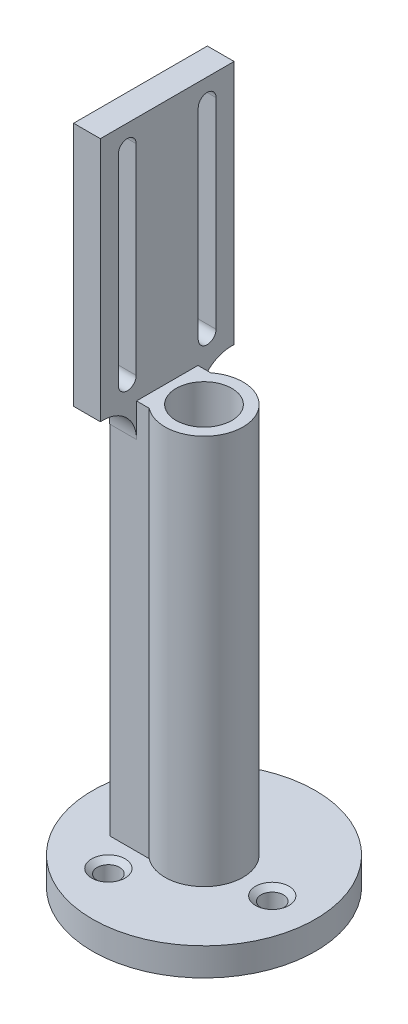
ISO-10303-21;
HEADER;
FILE_DESCRIPTION(('STEP AP214'),'2;1');
FILE_NAME('part.step','',(''),(''),'','','');
FILE_SCHEMA(('AUTOMOTIVE_DESIGN { 1 0 10303 214 1 1 1 1 }'));
ENDSEC;
DATA;
#1=APPLICATION_CONTEXT('core data for automotive mechanical design processes');
#2=APPLICATION_PROTOCOL_DEFINITION('international standard','automotive_design',2000,#1);
#3=PRODUCT_CONTEXT('',#1,'mechanical');
#4=PRODUCT('Part','Part','',(#3));
#5=PRODUCT_RELATED_PRODUCT_CATEGORY('part','',(#4));
#6=PRODUCT_DEFINITION_FORMATION('','',#4);
#7=PRODUCT_DEFINITION_CONTEXT('part definition',#1,'design');
#8=PRODUCT_DEFINITION('design','',#6,#7);
#9=PRODUCT_DEFINITION_SHAPE('','',#8);
#10=(LENGTH_UNIT() NAMED_UNIT(*) SI_UNIT(.MILLI.,.METRE.));
#11=(NAMED_UNIT(*) PLANE_ANGLE_UNIT() SI_UNIT($,.RADIAN.));
#12=(NAMED_UNIT(*) SI_UNIT($,.STERADIAN.) SOLID_ANGLE_UNIT());
#13=UNCERTAINTY_MEASURE_WITH_UNIT(LENGTH_MEASURE(1.E-05),#10,'distance_accuracy_value','');
#14=(GEOMETRIC_REPRESENTATION_CONTEXT(3) GLOBAL_UNCERTAINTY_ASSIGNED_CONTEXT((#13)) GLOBAL_UNIT_ASSIGNED_CONTEXT((#10,
#11,#12)) REPRESENTATION_CONTEXT('',''));
#15=CARTESIAN_POINT('',(0.,0.,0.));
#16=DIRECTION('',(0.,0.,1.));
#17=DIRECTION('',(1.,0.,0.));
#18=AXIS2_PLACEMENT_3D('',#15,#16,#17);
#19=CARTESIAN_POINT('',(6.35,114.3,0.));
#20=DIRECTION('',(0.,-1.,0.));
#21=DIRECTION('',(0.,0.,-1.));
#22=AXIS2_PLACEMENT_3D('',#19,#20,#21);
#23=PLANE('',#22);
#24=CARTESIAN_POINT('',(0.,114.3,0.));
#25=DIRECTION('',(0.,1.,0.));
#26=DIRECTION('',(0.,0.,1.));
#27=AXIS2_PLACEMENT_3D('',#24,#25,#26);
#28=CIRCLE('',#27,6.35);
#29=CARTESIAN_POINT('',(0.,114.3,6.35));
#30=VERTEX_POINT('',#29);
#31=EDGE_CURVE('E330',#30,#30,#28,.T.);
#32=ORIENTED_EDGE('',*,*,#31,.F.);
#33=EDGE_LOOP('',(#32));
#34=FACE_BOUND('',#33,.T.);
#35=DIRECTION('',(0.,0.,-1.));
#36=VECTOR('',#35,1.);
#37=CARTESIAN_POINT('',(-8.38200000000001,114.3,15.24));
#38=LINE('',#37,#36);
#39=CARTESIAN_POINT('',(-8.38200000000001,114.3,7.));
#40=VERTEX_POINT('',#39);
#41=CARTESIAN_POINT('',(-8.38200000000001,114.3,-6.99999999999998));
#42=VERTEX_POINT('',#41);
#43=EDGE_CURVE('E260',#40,#42,#38,.T.);
#44=ORIENTED_EDGE('',*,*,#43,.F.);
#45=DIRECTION('',(1.,0.,0.));
#46=VECTOR('',#45,1.);
#47=CARTESIAN_POINT('',(-5.48015510729397,114.3,7.));
#48=LINE('',#47,#46);
#49=CARTESIAN_POINT('',(-5.48015510729397,114.3,7.));
#50=VERTEX_POINT('',#49);
#51=EDGE_CURVE('E282',#40,#50,#48,.T.);
#52=ORIENTED_EDGE('',*,*,#51,.T.);
#53=CARTESIAN_POINT('',(0.,114.3,0.));
#54=DIRECTION('',(0.,1.,0.));
#55=DIRECTION('',(0.,0.,1.));
#56=AXIS2_PLACEMENT_3D('',#53,#54,#55);
#57=CIRCLE('',#56,8.89000000000001);
#58=CARTESIAN_POINT('',(-5.48015510729397,114.3,-7.));
#59=VERTEX_POINT('',#58);
#60=EDGE_CURVE('E327',#50,#59,#57,.T.);
#61=ORIENTED_EDGE('',*,*,#60,.T.);
#62=DIRECTION('',(-1.,0.,0.));
#63=VECTOR('',#62,1.);
#64=CARTESIAN_POINT('',(-14.478,114.3,-7.));
#65=LINE('',#64,#63);
#66=EDGE_CURVE('E279',#59,#42,#65,.T.);
#67=ORIENTED_EDGE('',*,*,#66,.T.);
#68=EDGE_LOOP('',(#44,#52,#61,#67));
#69=FACE_BOUND('',#68,.T.);
#70=ADVANCED_FACE('F37',(#34,#69),#23,.F.);
#71=CARTESIAN_POINT('',(0.,131.176985840386,0.));
#72=DIRECTION('',(0.,1.,0.));
#73=DIRECTION('',(0.,0.,1.));
#74=AXIS2_PLACEMENT_3D('',#71,#72,#73);
#75=CYLINDRICAL_SURFACE('',#74,8.89000000000001);
#76=DIRECTION('',(0.,-1.,0.));
#77=VECTOR('',#76,1.);
#78=CARTESIAN_POINT('',(-5.48015510729397,114.3,-7.));
#79=LINE('',#78,#77);
#80=CARTESIAN_POINT('',(-5.48015510729397,25.4,-7.));
#81=VERTEX_POINT('',#80);
#82=EDGE_CURVE('E298',#59,#81,#79,.T.);
#83=ORIENTED_EDGE('',*,*,#82,.F.);
#84=ORIENTED_EDGE('',*,*,#60,.F.);
#85=DIRECTION('',(0.,-1.,0.));
#86=VECTOR('',#85,1.);
#87=CARTESIAN_POINT('',(-5.48015510729397,114.3,7.));
#88=LINE('',#87,#86);
#89=CARTESIAN_POINT('',(-5.48015510729397,25.4,7.));
#90=VERTEX_POINT('',#89);
#91=EDGE_CURVE('E285',#50,#90,#88,.T.);
#92=ORIENTED_EDGE('',*,*,#91,.T.);
#93=CARTESIAN_POINT('',(0.,25.4,0.));
#94=DIRECTION('',(0.,1.,0.));
#95=DIRECTION('',(0.,0.,1.));
#96=AXIS2_PLACEMENT_3D('',#93,#94,#95);
#97=CIRCLE('',#96,8.89000000000001);
#98=EDGE_CURVE('E342',#90,#81,#97,.T.);
#99=ORIENTED_EDGE('',*,*,#98,.T.);
#100=EDGE_LOOP('',(#83,#84,#92,#99));
#101=FACE_BOUND('',#100,.T.);
#102=ADVANCED_FACE('F419',(#101),#75,.T.);
#103=CARTESIAN_POINT('',(25.4,25.4,0.));
#104=DIRECTION('',(0.,-1.,0.));
#105=DIRECTION('',(0.,0.,-1.));
#106=AXIS2_PLACEMENT_3D('',#103,#104,#105);
#107=PLANE('',#106);
#108=CARTESIAN_POINT('',(0.,25.4,0.));
#109=DIRECTION('',(0.,1.,0.));
#110=DIRECTION('',(0.,0.,1.));
#111=AXIS2_PLACEMENT_3D('',#108,#109,#110);
#112=CIRCLE('',#111,25.4);
#113=CARTESIAN_POINT('',(0.,25.4,25.4));
#114=VERTEX_POINT('',#113);
#115=EDGE_CURVE('E339',#114,#114,#112,.T.);
#116=ORIENTED_EDGE('',*,*,#115,.T.);
#117=EDGE_LOOP('',(#116));
#118=FACE_BOUND('',#117,.T.);
#119=CARTESIAN_POINT('',(-8.21231440560172,25.4,13.5857836396545));
#120=DIRECTION('',(0.,1.,0.));
#121=DIRECTION('',(0.,0.,1.));
#122=AXIS2_PLACEMENT_3D('',#119,#120,#121);
#123=CIRCLE('',#122,3.81);
#124=CARTESIAN_POINT('',(-8.21231440560172,25.4,17.3957836396545));
#125=VERTEX_POINT('',#124);
#126=EDGE_CURVE('E318',#125,#125,#123,.T.);
#127=ORIENTED_EDGE('',*,*,#126,.F.);
#128=EDGE_LOOP('',(#127));
#129=FACE_BOUND('',#128,.T.);
#130=CARTESIAN_POINT('',(15.8717909650625,25.4,0.319181079288262));
#131=DIRECTION('',(0.,1.,0.));
#132=DIRECTION('',(0.,0.,1.));
#133=AXIS2_PLACEMENT_3D('',#130,#131,#132);
#134=CIRCLE('',#133,3.81);
#135=CARTESIAN_POINT('',(15.8717909650625,25.4,4.12918107928826));
#136=VERTEX_POINT('',#135);
#137=EDGE_CURVE('E309',#136,#136,#134,.T.);
#138=ORIENTED_EDGE('',*,*,#137,.F.);
#139=EDGE_LOOP('',(#138));
#140=FACE_BOUND('',#139,.T.);
#141=CARTESIAN_POINT('',(-7.65947655945847,25.4,-13.904964718945));
#142=DIRECTION('',(0.,1.,0.));
#143=DIRECTION('',(0.,0.,1.));
#144=AXIS2_PLACEMENT_3D('',#141,#142,#143);
#145=CIRCLE('',#144,3.81);
#146=CARTESIAN_POINT('',(-7.65947655945847,25.4,-10.094964718945));
#147=VERTEX_POINT('',#146);
#148=EDGE_CURVE('E300',#147,#147,#145,.T.);
#149=ORIENTED_EDGE('',*,*,#148,.F.);
#150=EDGE_LOOP('',(#149));
#151=FACE_BOUND('',#150,.T.);
#152=DIRECTION('',(-1.,0.,0.));
#153=VECTOR('',#152,1.);
#154=CARTESIAN_POINT('',(-14.478,25.4,-7.));
#155=LINE('',#154,#153);
#156=CARTESIAN_POINT('',(-14.478,25.4,-7.));
#157=VERTEX_POINT('',#156);
#158=EDGE_CURVE('E278',#81,#157,#155,.T.);
#159=ORIENTED_EDGE('',*,*,#158,.F.);
#160=ORIENTED_EDGE('',*,*,#98,.F.);
#161=DIRECTION('',(1.,0.,0.));
#162=VECTOR('',#161,1.);
#163=CARTESIAN_POINT('',(-5.48015510729397,25.4,7.));
#164=LINE('',#163,#162);
#165=CARTESIAN_POINT('',(-14.478,25.4,7.));
#166=VERTEX_POINT('',#165);
#167=EDGE_CURVE('E283',#166,#90,#164,.T.);
#168=ORIENTED_EDGE('',*,*,#167,.F.);
#169=DIRECTION('',(0.,0.,1.));
#170=VECTOR('',#169,1.);
#171=CARTESIAN_POINT('',(-14.478,25.4,7.));
#172=LINE('',#171,#170);
#173=EDGE_CURVE('E288',#157,#166,#172,.T.);
#174=ORIENTED_EDGE('',*,*,#173,.F.);
#175=EDGE_LOOP('',(#159,#160,#168,#174));
#176=FACE_BOUND('',#175,.T.);
#177=ADVANCED_FACE('F384',(#118,#129,#140,#151,#176),#107,.F.);
#178=CARTESIAN_POINT('',(0.,131.176985840386,0.));
#179=DIRECTION('',(0.,1.,0.));
#180=DIRECTION('',(0.,0.,1.));
#181=AXIS2_PLACEMENT_3D('',#178,#179,#180);
#182=CYLINDRICAL_SURFACE('',#181,25.4);
#183=ORIENTED_EDGE('',*,*,#115,.F.);
#184=EDGE_LOOP('',(#183));
#185=FACE_BOUND('',#184,.T.);
#186=CARTESIAN_POINT('',(0.,19.05,0.));
#187=DIRECTION('',(0.,1.,0.));
#188=DIRECTION('',(0.,0.,1.));
#189=AXIS2_PLACEMENT_3D('',#186,#187,#188);
#190=CIRCLE('',#189,25.4);
#191=CARTESIAN_POINT('',(0.,19.05,25.4));
#192=VERTEX_POINT('',#191);
#193=EDGE_CURVE('E336',#192,#192,#190,.T.);
#194=ORIENTED_EDGE('',*,*,#193,.T.);
#195=EDGE_LOOP('',(#194));
#196=FACE_BOUND('',#195,.T.);
#197=ADVANCED_FACE('F440',(#185,#196),#182,.T.);
#198=CARTESIAN_POINT('',(6.35000000000001,19.05,0.));
#199=DIRECTION('',(0.,1.,0.));
#200=DIRECTION('',(0.,0.,1.));
#201=AXIS2_PLACEMENT_3D('',#198,#199,#200);
#202=PLANE('',#201);
#203=CARTESIAN_POINT('',(-7.65947655945847,19.05,-13.904964718945));
#204=DIRECTION('',(0.,1.,0.));
#205=DIRECTION('',(0.,0.,1.));
#206=AXIS2_PLACEMENT_3D('',#203,#204,#205);
#207=CIRCLE('',#206,2.5527);
#208=CARTESIAN_POINT('',(-7.65947655945847,19.05,-11.352264718945));
#209=VERTEX_POINT('',#208);
#210=EDGE_CURVE('E306',#209,#209,#207,.T.);
#211=ORIENTED_EDGE('',*,*,#210,.T.);
#212=EDGE_LOOP('',(#211));
#213=FACE_BOUND('',#212,.T.);
#214=CARTESIAN_POINT('',(15.8717909650625,19.05,0.319181079288262));
#215=DIRECTION('',(0.,1.,0.));
#216=DIRECTION('',(0.,0.,1.));
#217=AXIS2_PLACEMENT_3D('',#214,#215,#216);
#218=CIRCLE('',#217,2.5527);
#219=CARTESIAN_POINT('',(15.8717909650625,19.05,2.87188107928826));
#220=VERTEX_POINT('',#219);
#221=EDGE_CURVE('E315',#220,#220,#218,.T.);
#222=ORIENTED_EDGE('',*,*,#221,.T.);
#223=EDGE_LOOP('',(#222));
#224=FACE_BOUND('',#223,.T.);
#225=CARTESIAN_POINT('',(-8.21231440560172,19.05,13.5857836396545));
#226=DIRECTION('',(0.,1.,0.));
#227=DIRECTION('',(0.,0.,1.));
#228=AXIS2_PLACEMENT_3D('',#225,#226,#227);
#229=CIRCLE('',#228,2.5527);
#230=CARTESIAN_POINT('',(-8.21231440560172,19.05,16.1384836396545));
#231=VERTEX_POINT('',#230);
#232=EDGE_CURVE('E324',#231,#231,#229,.T.);
#233=ORIENTED_EDGE('',*,*,#232,.T.);
#234=EDGE_LOOP('',(#233));
#235=FACE_BOUND('',#234,.T.);
#236=ORIENTED_EDGE('',*,*,#193,.F.);
#237=EDGE_LOOP('',(#236));
#238=FACE_BOUND('',#237,.T.);
#239=CARTESIAN_POINT('',(0.,19.05,0.));
#240=DIRECTION('',(0.,1.,0.));
#241=DIRECTION('',(0.,0.,1.));
#242=AXIS2_PLACEMENT_3D('',#239,#240,#241);
#243=CIRCLE('',#242,6.35000000000001);
#244=CARTESIAN_POINT('',(0.,19.05,6.35000000000001));
#245=VERTEX_POINT('',#244);
#246=EDGE_CURVE('E333',#245,#245,#243,.T.);
#247=ORIENTED_EDGE('',*,*,#246,.T.);
#248=EDGE_LOOP('',(#247));
#249=FACE_BOUND('',#248,.T.);
#250=ADVANCED_FACE('F436',(#213,#224,#235,#238,#249),#202,.F.);
#251=CARTESIAN_POINT('',(0.,131.176985840386,0.));
#252=DIRECTION('',(0.,1.,0.));
#253=DIRECTION('',(0.,0.,1.));
#254=AXIS2_PLACEMENT_3D('',#251,#252,#253);
#255=CYLINDRICAL_SURFACE('',#254,6.35000000000001);
#256=ORIENTED_EDGE('',*,*,#246,.F.);
#257=EDGE_LOOP('',(#256));
#258=FACE_BOUND('',#257,.T.);
#259=ORIENTED_EDGE('',*,*,#31,.T.);
#260=EDGE_LOOP('',(#259));
#261=FACE_BOUND('',#260,.T.);
#262=ADVANCED_FACE('F433',(#258,#261),#255,.F.);
#263=CARTESIAN_POINT('',(-8.21231440560172,25.4,13.5857836396545));
#264=DIRECTION('',(0.,1.,0.));
#265=DIRECTION('',(0.,0.,1.));
#266=AXIS2_PLACEMENT_3D('',#263,#264,#265);
#267=CYLINDRICAL_SURFACE('',#266,2.5527);
#268=ORIENTED_EDGE('',*,*,#232,.F.);
#269=EDGE_LOOP('',(#268));
#270=FACE_BOUND('',#269,.T.);
#271=CARTESIAN_POINT('',(-8.21231440560172,24.3450000337208,13.5857836396545));
#272=DIRECTION('',(0.,1.,0.));
#273=DIRECTION('',(0.,0.,1.));
#274=AXIS2_PLACEMENT_3D('',#271,#272,#273);
#275=CIRCLE('',#274,2.5527);
#276=CARTESIAN_POINT('',(-8.21231440560172,24.3450000337208,16.1384836396545));
#277=VERTEX_POINT('',#276);
#278=EDGE_CURVE('E321',#277,#277,#275,.T.);
#279=ORIENTED_EDGE('',*,*,#278,.T.);
#280=EDGE_LOOP('',(#279));
#281=FACE_BOUND('',#280,.T.);
#282=ADVANCED_FACE('F431',(#270,#281),#267,.F.);
#283=CARTESIAN_POINT('',(-8.21231440560172,25.4,13.5857836396545));
#284=DIRECTION('',(0.,1.,0.));
#285=DIRECTION('',(0.,0.,1.));
#286=AXIS2_PLACEMENT_3D('',#283,#284,#285);
#287=CONICAL_SURFACE('',#286,3.81,0.872664625997163);
#288=ORIENTED_EDGE('',*,*,#278,.F.);
#289=EDGE_LOOP('',(#288));
#290=FACE_BOUND('',#289,.T.);
#291=ORIENTED_EDGE('',*,*,#126,.T.);
#292=EDGE_LOOP('',(#291));
#293=FACE_BOUND('',#292,.T.);
#294=ADVANCED_FACE('F510',(#290,#293),#287,.F.);
#295=CARTESIAN_POINT('',(15.8717909650625,25.4,0.319181079288262));
#296=DIRECTION('',(0.,1.,0.));
#297=DIRECTION('',(0.,0.,1.));
#298=AXIS2_PLACEMENT_3D('',#295,#296,#297);
#299=CYLINDRICAL_SURFACE('',#298,2.5527);
#300=ORIENTED_EDGE('',*,*,#221,.F.);
#301=EDGE_LOOP('',(#300));
#302=FACE_BOUND('',#301,.T.);
#303=CARTESIAN_POINT('',(15.8717909650625,24.3450000337208,0.319181079288262));
#304=DIRECTION('',(0.,1.,0.));
#305=DIRECTION('',(0.,0.,1.));
#306=AXIS2_PLACEMENT_3D('',#303,#304,#305);
#307=CIRCLE('',#306,2.5527);
#308=CARTESIAN_POINT('',(15.8717909650625,24.3450000337208,2.87188107928826));
#309=VERTEX_POINT('',#308);
#310=EDGE_CURVE('E312',#309,#309,#307,.T.);
#311=ORIENTED_EDGE('',*,*,#310,.T.);
#312=EDGE_LOOP('',(#311));
#313=FACE_BOUND('',#312,.T.);
#314=ADVANCED_FACE('F507',(#302,#313),#299,.F.);
#315=CARTESIAN_POINT('',(15.8717909650625,25.4,0.319181079288262));
#316=DIRECTION('',(0.,1.,0.));
#317=DIRECTION('',(0.,0.,1.));
#318=AXIS2_PLACEMENT_3D('',#315,#316,#317);
#319=CONICAL_SURFACE('',#318,3.81,0.872664625997163);
#320=ORIENTED_EDGE('',*,*,#310,.F.);
#321=EDGE_LOOP('',(#320));
#322=FACE_BOUND('',#321,.T.);
#323=ORIENTED_EDGE('',*,*,#137,.T.);
#324=EDGE_LOOP('',(#323));
#325=FACE_BOUND('',#324,.T.);
#326=ADVANCED_FACE('F503',(#322,#325),#319,.F.);
#327=CARTESIAN_POINT('',(-7.65947655945847,25.4,-13.904964718945));
#328=DIRECTION('',(0.,1.,0.));
#329=DIRECTION('',(0.,0.,1.));
#330=AXIS2_PLACEMENT_3D('',#327,#328,#329);
#331=CYLINDRICAL_SURFACE('',#330,2.5527);
#332=ORIENTED_EDGE('',*,*,#210,.F.);
#333=EDGE_LOOP('',(#332));
#334=FACE_BOUND('',#333,.T.);
#335=CARTESIAN_POINT('',(-7.65947655945847,24.3450000337208,-13.904964718945));
#336=DIRECTION('',(0.,1.,0.));
#337=DIRECTION('',(0.,0.,1.));
#338=AXIS2_PLACEMENT_3D('',#335,#336,#337);
#339=CIRCLE('',#338,2.5527);
#340=CARTESIAN_POINT('',(-7.65947655945847,24.3450000337208,-11.352264718945));
#341=VERTEX_POINT('',#340);
#342=EDGE_CURVE('E303',#341,#341,#339,.T.);
#343=ORIENTED_EDGE('',*,*,#342,.T.);
#344=EDGE_LOOP('',(#343));
#345=FACE_BOUND('',#344,.T.);
#346=ADVANCED_FACE('F499',(#334,#345),#331,.F.);
#347=CARTESIAN_POINT('',(-7.65947655945847,25.4,-13.904964718945));
#348=DIRECTION('',(0.,1.,0.));
#349=DIRECTION('',(0.,0.,1.));
#350=AXIS2_PLACEMENT_3D('',#347,#348,#349);
#351=CONICAL_SURFACE('',#350,3.81,0.872664625997163);
#352=ORIENTED_EDGE('',*,*,#342,.F.);
#353=EDGE_LOOP('',(#352));
#354=FACE_BOUND('',#353,.T.);
#355=ORIENTED_EDGE('',*,*,#148,.T.);
#356=EDGE_LOOP('',(#355));
#357=FACE_BOUND('',#356,.T.);
#358=ADVANCED_FACE('F496',(#354,#357),#351,.F.);
#359=CARTESIAN_POINT('',(-14.478,114.3,-7.));
#360=DIRECTION('',(0.,0.,1.));
#361=DIRECTION('',(1.,0.,0.));
#362=AXIS2_PLACEMENT_3D('',#359,#360,#361);
#363=PLANE('',#362);
#364=DIRECTION('',(0.,-1.,0.));
#365=VECTOR('',#364,1.);
#366=CARTESIAN_POINT('',(-14.478,114.3,-7.));
#367=LINE('',#366,#365);
#368=CARTESIAN_POINT('',(-14.478,106.68,-7.));
#369=VERTEX_POINT('',#368);
#370=EDGE_CURVE('E296',#369,#157,#367,.T.);
#371=ORIENTED_EDGE('',*,*,#370,.F.);
#372=DIRECTION('',(-1.,0.,0.));
#373=VECTOR('',#372,1.);
#374=CARTESIAN_POINT('',(-8.38200000000001,106.68,-7.));
#375=LINE('',#374,#373);
#376=CARTESIAN_POINT('',(-8.38200000000001,106.68,-7.));
#377=VERTEX_POINT('',#376);
#378=EDGE_CURVE('E350',#369,#377,#375,.F.);
#379=ORIENTED_EDGE('',*,*,#378,.T.);
#380=DIRECTION('',(0.,1.,0.));
#381=VECTOR('',#380,1.);
#382=CARTESIAN_POINT('',(-8.38200000000001,170.18,-7.));
#383=LINE('',#382,#381);
#384=EDGE_CURVE('E348',#377,#42,#383,.T.);
#385=ORIENTED_EDGE('',*,*,#384,.T.);
#386=ORIENTED_EDGE('',*,*,#66,.F.);
#387=ORIENTED_EDGE('',*,*,#82,.T.);
#388=ORIENTED_EDGE('',*,*,#158,.T.);
#389=EDGE_LOOP('',(#371,#379,#385,#386,#387,#388));
#390=FACE_BOUND('',#389,.T.);
#391=ADVANCED_FACE('F377',(#390),#363,.F.);
#392=CARTESIAN_POINT('',(-14.478,114.3,7.));
#393=DIRECTION('',(1.,0.,0.));
#394=DIRECTION('',(0.,0.,-1.));
#395=AXIS2_PLACEMENT_3D('',#392,#393,#394);
#396=PLANE('',#395);
#397=DIRECTION('',(0.,1.,0.));
#398=VECTOR('',#397,1.);
#399=CARTESIAN_POINT('',(-14.478,119.38,11.132));
#400=LINE('',#399,#398);
#401=CARTESIAN_POINT('',(-14.478,119.38,11.132));
#402=VERTEX_POINT('',#401);
#403=CARTESIAN_POINT('',(-14.478,165.1,11.132));
#404=VERTEX_POINT('',#403);
#405=EDGE_CURVE('E197',#402,#404,#400,.T.);
#406=ORIENTED_EDGE('',*,*,#405,.F.);
#407=CARTESIAN_POINT('',(-14.478,119.38,9.1));
#408=DIRECTION('',(1.,0.,0.));
#409=DIRECTION('',(0.,0.,-1.));
#410=AXIS2_PLACEMENT_3D('',#407,#408,#409);
#411=CIRCLE('',#410,2.032);
#412=CARTESIAN_POINT('',(-14.478,119.38,7.068));
#413=VERTEX_POINT('',#412);
#414=EDGE_CURVE('E175',#413,#402,#411,.F.);
#415=ORIENTED_EDGE('',*,*,#414,.F.);
#416=DIRECTION('',(0.,-1.,0.));
#417=VECTOR('',#416,1.);
#418=CARTESIAN_POINT('',(-14.478,119.38,7.068));
#419=LINE('',#418,#417);
#420=CARTESIAN_POINT('',(-14.478,165.1,7.06800000000002));
#421=VERTEX_POINT('',#420);
#422=EDGE_CURVE('E187',#421,#413,#419,.T.);
#423=ORIENTED_EDGE('',*,*,#422,.F.);
#424=CARTESIAN_POINT('',(-14.478,165.1,9.1));
#425=DIRECTION('',(1.,0.,0.));
#426=DIRECTION('',(0.,0.,-1.));
#427=AXIS2_PLACEMENT_3D('',#424,#425,#426);
#428=CIRCLE('',#427,2.03199999999998);
#429=EDGE_CURVE('E201',#404,#421,#428,.F.);
#430=ORIENTED_EDGE('',*,*,#429,.F.);
#431=EDGE_LOOP('',(#406,#415,#423,#430));
#432=FACE_BOUND('',#431,.T.);
#433=DIRECTION('',(0.,1.,0.));
#434=VECTOR('',#433,1.);
#435=CARTESIAN_POINT('',(-14.478,119.38,-7.068));
#436=LINE('',#435,#434);
#437=CARTESIAN_POINT('',(-14.478,119.38,-7.068));
#438=VERTEX_POINT('',#437);
#439=CARTESIAN_POINT('',(-14.478,165.1,-7.06800000000002));
#440=VERTEX_POINT('',#439);
#441=EDGE_CURVE('E217',#438,#440,#436,.T.);
#442=ORIENTED_EDGE('',*,*,#441,.F.);
#443=CARTESIAN_POINT('',(-14.478,119.38,-9.1));
#444=DIRECTION('',(1.,0.,0.));
#445=DIRECTION('',(0.,0.,-1.));
#446=AXIS2_PLACEMENT_3D('',#443,#444,#445);
#447=CIRCLE('',#446,2.032);
#448=CARTESIAN_POINT('',(-14.478,119.38,-11.132));
#449=VERTEX_POINT('',#448);
#450=EDGE_CURVE('E220',#449,#438,#447,.F.);
#451=ORIENTED_EDGE('',*,*,#450,.F.);
#452=DIRECTION('',(0.,-1.,0.));
#453=VECTOR('',#452,1.);
#454=CARTESIAN_POINT('',(-14.478,119.38,-11.132));
#455=LINE('',#454,#453);
#456=CARTESIAN_POINT('',(-14.478,165.1,-11.132));
#457=VERTEX_POINT('',#456);
#458=EDGE_CURVE('E237',#457,#449,#455,.T.);
#459=ORIENTED_EDGE('',*,*,#458,.F.);
#460=CARTESIAN_POINT('',(-14.478,165.1,-9.1));
#461=DIRECTION('',(1.,0.,0.));
#462=DIRECTION('',(0.,0.,-1.));
#463=AXIS2_PLACEMENT_3D('',#460,#461,#462);
#464=CIRCLE('',#463,2.03199999999998);
#465=EDGE_CURVE('E215',#440,#457,#464,.F.);
#466=ORIENTED_EDGE('',*,*,#465,.F.);
#467=EDGE_LOOP('',(#442,#451,#459,#466));
#468=FACE_BOUND('',#467,.T.);
#469=ORIENTED_EDGE('',*,*,#173,.T.);
#470=DIRECTION('',(0.,-1.,0.));
#471=VECTOR('',#470,1.);
#472=CARTESIAN_POINT('',(-14.478,114.3,7.));
#473=LINE('',#472,#471);
#474=CARTESIAN_POINT('',(-14.478,106.68,7.));
#475=VERTEX_POINT('',#474);
#476=EDGE_CURVE('E294',#475,#166,#473,.T.);
#477=ORIENTED_EDGE('',*,*,#476,.F.);
#478=CARTESIAN_POINT('',(-14.478,106.68,14.62));
#479=DIRECTION('',(1.,0.,0.));
#480=DIRECTION('',(0.,0.,-1.));
#481=AXIS2_PLACEMENT_3D('',#478,#479,#480);
#482=CIRCLE('',#481,7.62);
#483=CARTESIAN_POINT('',(-14.478,114.3,14.62));
#484=VERTEX_POINT('',#483);
#485=EDGE_CURVE('E11',#475,#484,#482,.T.);
#486=ORIENTED_EDGE('',*,*,#485,.T.);
#487=DIRECTION('',(0.,0.,1.));
#488=VECTOR('',#487,1.);
#489=CARTESIAN_POINT('',(-14.478,114.3,-15.24));
#490=LINE('',#489,#488);
#491=CARTESIAN_POINT('',(-14.478,114.3,15.24));
#492=VERTEX_POINT('',#491);
#493=EDGE_CURVE('E262',#484,#492,#490,.T.);
#494=ORIENTED_EDGE('',*,*,#493,.T.);
#495=DIRECTION('',(0.,-1.,0.));
#496=VECTOR('',#495,1.);
#497=CARTESIAN_POINT('',(-14.478,170.18,15.24));
#498=LINE('',#497,#496);
#499=CARTESIAN_POINT('',(-14.478,170.18,15.24));
#500=VERTEX_POINT('',#499);
#501=EDGE_CURVE('E269',#500,#492,#498,.T.);
#502=ORIENTED_EDGE('',*,*,#501,.F.);
#503=DIRECTION('',(0.,0.,1.));
#504=VECTOR('',#503,1.);
#505=CARTESIAN_POINT('',(-14.478,170.18,-15.24));
#506=LINE('',#505,#504);
#507=CARTESIAN_POINT('',(-14.478,170.18,-15.24));
#508=VERTEX_POINT('',#507);
#509=EDGE_CURVE('E252',#508,#500,#506,.T.);
#510=ORIENTED_EDGE('',*,*,#509,.F.);
#511=DIRECTION('',(0.,-1.,0.));
#512=VECTOR('',#511,1.);
#513=CARTESIAN_POINT('',(-14.478,170.18,-15.24));
#514=LINE('',#513,#512);
#515=CARTESIAN_POINT('',(-14.478,114.3,-15.24));
#516=VERTEX_POINT('',#515);
#517=EDGE_CURVE('E272',#508,#516,#514,.T.);
#518=ORIENTED_EDGE('',*,*,#517,.T.);
#519=CARTESIAN_POINT('',(-14.478,114.3,-14.62));
#520=VERTEX_POINT('',#519);
#521=EDGE_CURVE('E263',#516,#520,#490,.T.);
#522=ORIENTED_EDGE('',*,*,#521,.T.);
#523=CARTESIAN_POINT('',(-14.478,106.68,-14.62));
#524=DIRECTION('',(1.,0.,0.));
#525=DIRECTION('',(0.,0.,-1.));
#526=AXIS2_PLACEMENT_3D('',#523,#524,#525);
#527=CIRCLE('',#526,7.62);
#528=EDGE_CURVE('E359',#520,#369,#527,.T.);
#529=ORIENTED_EDGE('',*,*,#528,.T.);
#530=ORIENTED_EDGE('',*,*,#370,.T.);
#531=EDGE_LOOP('',(#469,#477,#486,#494,#502,#510,#518,#522,#529,#530));
#532=FACE_BOUND('',#531,.T.);
#533=ADVANCED_FACE('F194',(#432,#468,#532),#396,.F.);
#534=CARTESIAN_POINT('',(-5.48015510729397,114.3,7.));
#535=DIRECTION('',(0.,0.,-1.));
#536=DIRECTION('',(-1.,0.,0.));
#537=AXIS2_PLACEMENT_3D('',#534,#535,#536);
#538=PLANE('',#537);
#539=ORIENTED_EDGE('',*,*,#51,.F.);
#540=DIRECTION('',(0.,-1.,0.));
#541=VECTOR('',#540,1.);
#542=CARTESIAN_POINT('',(-8.38200000000001,170.18,7.));
#543=LINE('',#542,#541);
#544=CARTESIAN_POINT('',(-8.38200000000001,106.68,7.));
#545=VERTEX_POINT('',#544);
#546=EDGE_CURVE('E52',#40,#545,#543,.T.);
#547=ORIENTED_EDGE('',*,*,#546,.T.);
#548=DIRECTION('',(1.,0.,0.));
#549=VECTOR('',#548,1.);
#550=CARTESIAN_POINT('',(-14.478,106.68,7.));
#551=LINE('',#550,#549);
#552=EDGE_CURVE('E356',#545,#475,#551,.F.);
#553=ORIENTED_EDGE('',*,*,#552,.T.);
#554=ORIENTED_EDGE('',*,*,#476,.T.);
#555=ORIENTED_EDGE('',*,*,#167,.T.);
#556=ORIENTED_EDGE('',*,*,#91,.F.);
#557=EDGE_LOOP('',(#539,#547,#553,#554,#555,#556));
#558=FACE_BOUND('',#557,.T.);
#559=ADVANCED_FACE('F483',(#558),#538,.F.);
#560=CARTESIAN_POINT('',(0.,114.3,0.));
#561=DIRECTION('',(0.,1.,0.));
#562=DIRECTION('',(0.,0.,1.));
#563=AXIS2_PLACEMENT_3D('',#560,#561,#562);
#564=PLANE('',#563);
#565=CARTESIAN_POINT('',(-8.38200000000001,114.3,-14.62));
#566=VERTEX_POINT('',#565);
#567=CARTESIAN_POINT('',(-8.38200000000001,114.3,-15.24));
#568=VERTEX_POINT('',#567);
#569=EDGE_CURVE('E191',#566,#568,#38,.T.);
#570=ORIENTED_EDGE('',*,*,#569,.F.);
#571=DIRECTION('',(-1.,0.,0.));
#572=VECTOR('',#571,1.);
#573=CARTESIAN_POINT('',(-14.478,114.3,-14.62));
#574=LINE('',#573,#572);
#575=EDGE_CURVE('E345',#566,#520,#574,.T.);
#576=ORIENTED_EDGE('',*,*,#575,.T.);
#577=ORIENTED_EDGE('',*,*,#521,.F.);
#578=DIRECTION('',(-1.,0.,0.));
#579=VECTOR('',#578,1.);
#580=CARTESIAN_POINT('',(-8.38200000000001,114.3,-15.24));
#581=LINE('',#580,#579);
#582=EDGE_CURVE('E259',#568,#516,#581,.T.);
#583=ORIENTED_EDGE('',*,*,#582,.F.);
#584=EDGE_LOOP('',(#570,#576,#577,#583));
#585=FACE_BOUND('',#584,.T.);
#586=ADVANCED_FACE('F371',(#585),#564,.F.);
#587=ORIENTED_EDGE('',*,*,#493,.F.);
#588=DIRECTION('',(1.,0.,0.));
#589=VECTOR('',#588,1.);
#590=CARTESIAN_POINT('',(-8.38200000000001,114.3,14.62));
#591=LINE('',#590,#589);
#592=CARTESIAN_POINT('',(-8.38200000000001,114.3,14.62));
#593=VERTEX_POINT('',#592);
#594=EDGE_CURVE('E353',#484,#593,#591,.T.);
#595=ORIENTED_EDGE('',*,*,#594,.T.);
#596=CARTESIAN_POINT('',(-8.38200000000001,114.3,15.24));
#597=VERTEX_POINT('',#596);
#598=EDGE_CURVE('E257',#597,#593,#38,.T.);
#599=ORIENTED_EDGE('',*,*,#598,.F.);
#600=DIRECTION('',(1.,0.,0.));
#601=VECTOR('',#600,1.);
#602=CARTESIAN_POINT('',(-14.478,114.3,15.24));
#603=LINE('',#602,#601);
#604=EDGE_CURVE('E250',#492,#597,#603,.T.);
#605=ORIENTED_EDGE('',*,*,#604,.F.);
#606=EDGE_LOOP('',(#587,#595,#599,#605));
#607=FACE_BOUND('',#606,.T.);
#608=ADVANCED_FACE('F394',(#607),#564,.F.);
#609=CARTESIAN_POINT('',(-8.38200000000001,170.18,15.24));
#610=DIRECTION('',(-1.,0.,0.));
#611=DIRECTION('',(0.,0.,1.));
#612=AXIS2_PLACEMENT_3D('',#609,#610,#611);
#613=PLANE('',#612);
#614=DIRECTION('',(0.,1.,0.));
#615=VECTOR('',#614,1.);
#616=CARTESIAN_POINT('',(-8.38200000000001,119.38,7.068));
#617=LINE('',#616,#615);
#618=CARTESIAN_POINT('',(-8.38200000000001,119.38,7.068));
#619=VERTEX_POINT('',#618);
#620=CARTESIAN_POINT('',(-8.38200000000001,165.1,7.06800000000001));
#621=VERTEX_POINT('',#620);
#622=EDGE_CURVE('E199',#619,#621,#617,.T.);
#623=ORIENTED_EDGE('',*,*,#622,.F.);
#624=CARTESIAN_POINT('',(-8.38200000000001,119.38,9.1));
#625=DIRECTION('',(1.,0.,0.));
#626=DIRECTION('',(0.,0.,-1.));
#627=AXIS2_PLACEMENT_3D('',#624,#625,#626);
#628=CIRCLE('',#627,2.032);
#629=CARTESIAN_POINT('',(-8.38200000000001,119.38,11.132));
#630=VERTEX_POINT('',#629);
#631=EDGE_CURVE('E178',#630,#619,#628,.T.);
#632=ORIENTED_EDGE('',*,*,#631,.F.);
#633=DIRECTION('',(0.,-1.,0.));
#634=VECTOR('',#633,1.);
#635=CARTESIAN_POINT('',(-8.38200000000001,119.38,11.132));
#636=LINE('',#635,#634);
#637=CARTESIAN_POINT('',(-8.38200000000001,165.1,11.132));
#638=VERTEX_POINT('',#637);
#639=EDGE_CURVE('E183',#638,#630,#636,.T.);
#640=ORIENTED_EDGE('',*,*,#639,.F.);
#641=CARTESIAN_POINT('',(-8.38200000000001,165.1,9.1));
#642=DIRECTION('',(1.,0.,0.));
#643=DIRECTION('',(0.,0.,-1.));
#644=AXIS2_PLACEMENT_3D('',#641,#642,#643);
#645=CIRCLE('',#644,2.03199999999998);
#646=EDGE_CURVE('E206',#621,#638,#645,.T.);
#647=ORIENTED_EDGE('',*,*,#646,.F.);
#648=EDGE_LOOP('',(#623,#632,#640,#647));
#649=FACE_BOUND('',#648,.T.);
#650=DIRECTION('',(0.,1.,0.));
#651=VECTOR('',#650,1.);
#652=CARTESIAN_POINT('',(-8.38200000000001,119.38,-11.132));
#653=LINE('',#652,#651);
#654=CARTESIAN_POINT('',(-8.38200000000001,119.38,-11.132));
#655=VERTEX_POINT('',#654);
#656=CARTESIAN_POINT('',(-8.38200000000001,165.1,-11.132));
#657=VERTEX_POINT('',#656);
#658=EDGE_CURVE('E225',#655,#657,#653,.T.);
#659=ORIENTED_EDGE('',*,*,#658,.F.);
#660=CARTESIAN_POINT('',(-8.38200000000001,119.38,-9.1));
#661=DIRECTION('',(1.,0.,0.));
#662=DIRECTION('',(0.,0.,1.));
#663=AXIS2_PLACEMENT_3D('',#660,#661,#662);
#664=CIRCLE('',#663,2.032);
#665=CARTESIAN_POINT('',(-8.38200000000001,119.38,-7.068));
#666=VERTEX_POINT('',#665);
#667=EDGE_CURVE('E223',#666,#655,#664,.T.);
#668=ORIENTED_EDGE('',*,*,#667,.F.);
#669=DIRECTION('',(0.,-1.,0.));
#670=VECTOR('',#669,1.);
#671=CARTESIAN_POINT('',(-8.38200000000001,119.38,-7.068));
#672=LINE('',#671,#670);
#673=CARTESIAN_POINT('',(-8.38200000000001,165.1,-7.06800000000002));
#674=VERTEX_POINT('',#673);
#675=EDGE_CURVE('E231',#674,#666,#672,.T.);
#676=ORIENTED_EDGE('',*,*,#675,.F.);
#677=CARTESIAN_POINT('',(-8.38200000000001,165.1,-9.1));
#678=DIRECTION('',(1.,0.,0.));
#679=DIRECTION('',(0.,0.,1.));
#680=AXIS2_PLACEMENT_3D('',#677,#678,#679);
#681=CIRCLE('',#680,2.03199999999998);
#682=EDGE_CURVE('E228',#657,#674,#681,.T.);
#683=ORIENTED_EDGE('',*,*,#682,.F.);
#684=EDGE_LOOP('',(#659,#668,#676,#683));
#685=FACE_BOUND('',#684,.T.);
#686=ORIENTED_EDGE('',*,*,#598,.T.);
#687=CARTESIAN_POINT('',(-8.38200000000001,106.68,14.62));
#688=DIRECTION('',(-1.,0.,0.));
#689=DIRECTION('',(0.,0.,1.));
#690=AXIS2_PLACEMENT_3D('',#687,#688,#689);
#691=CIRCLE('',#690,7.62);
#692=EDGE_CURVE('E45',#593,#545,#691,.T.);
#693=ORIENTED_EDGE('',*,*,#692,.T.);
#694=ORIENTED_EDGE('',*,*,#546,.F.);
#695=ORIENTED_EDGE('',*,*,#43,.T.);
#696=ORIENTED_EDGE('',*,*,#384,.F.);
#697=CARTESIAN_POINT('',(-8.38200000000001,106.68,-14.62));
#698=DIRECTION('',(-1.,0.,0.));
#699=DIRECTION('',(0.,0.,1.));
#700=AXIS2_PLACEMENT_3D('',#697,#698,#699);
#701=CIRCLE('',#700,7.62);
#702=EDGE_CURVE('E361',#377,#566,#701,.T.);
#703=ORIENTED_EDGE('',*,*,#702,.T.);
#704=ORIENTED_EDGE('',*,*,#569,.T.);
#705=DIRECTION('',(0.,-1.,0.));
#706=VECTOR('',#705,1.);
#707=CARTESIAN_POINT('',(-8.38200000000001,170.18,-15.24));
#708=LINE('',#707,#706);
#709=CARTESIAN_POINT('',(-8.38200000000001,170.18,-15.24));
#710=VERTEX_POINT('',#709);
#711=EDGE_CURVE('E275',#710,#568,#708,.T.);
#712=ORIENTED_EDGE('',*,*,#711,.F.);
#713=DIRECTION('',(0.,0.,-1.));
#714=VECTOR('',#713,1.);
#715=CARTESIAN_POINT('',(-8.38200000000001,170.18,15.24));
#716=LINE('',#715,#714);
#717=CARTESIAN_POINT('',(-8.38200000000001,170.18,15.24));
#718=VERTEX_POINT('',#717);
#719=EDGE_CURVE('E246',#718,#710,#716,.T.);
#720=ORIENTED_EDGE('',*,*,#719,.F.);
#721=DIRECTION('',(0.,-1.,0.));
#722=VECTOR('',#721,1.);
#723=CARTESIAN_POINT('',(-8.38200000000001,170.18,15.24));
#724=LINE('',#723,#722);
#725=EDGE_CURVE('E256',#718,#597,#724,.T.);
#726=ORIENTED_EDGE('',*,*,#725,.T.);
#727=EDGE_LOOP('',(#686,#693,#694,#695,#696,#703,#704,#712,#720,#726));
#728=FACE_BOUND('',#727,.T.);
#729=ADVANCED_FACE('F364',(#649,#685,#728),#613,.F.);
#730=CARTESIAN_POINT('',(-8.38200000000001,170.18,-15.24));
#731=DIRECTION('',(0.,0.,1.));
#732=DIRECTION('',(1.,0.,0.));
#733=AXIS2_PLACEMENT_3D('',#730,#731,#732);
#734=PLANE('',#733);
#735=ORIENTED_EDGE('',*,*,#582,.T.);
#736=ORIENTED_EDGE('',*,*,#517,.F.);
#737=DIRECTION('',(-1.,0.,0.));
#738=VECTOR('',#737,1.);
#739=CARTESIAN_POINT('',(-8.38200000000001,170.18,-15.24));
#740=LINE('',#739,#738);
#741=EDGE_CURVE('E249',#710,#508,#740,.T.);
#742=ORIENTED_EDGE('',*,*,#741,.F.);
#743=ORIENTED_EDGE('',*,*,#711,.T.);
#744=EDGE_LOOP('',(#735,#736,#742,#743));
#745=FACE_BOUND('',#744,.T.);
#746=ADVANCED_FACE('F407',(#745),#734,.F.);
#747=CARTESIAN_POINT('',(-14.478,170.18,15.24));
#748=DIRECTION('',(0.,0.,-1.));
#749=DIRECTION('',(-1.,0.,0.));
#750=AXIS2_PLACEMENT_3D('',#747,#748,#749);
#751=PLANE('',#750);
#752=ORIENTED_EDGE('',*,*,#604,.T.);
#753=ORIENTED_EDGE('',*,*,#725,.F.);
#754=DIRECTION('',(1.,0.,0.));
#755=VECTOR('',#754,1.);
#756=CARTESIAN_POINT('',(-14.478,170.18,15.24));
#757=LINE('',#756,#755);
#758=EDGE_CURVE('E254',#500,#718,#757,.T.);
#759=ORIENTED_EDGE('',*,*,#758,.F.);
#760=ORIENTED_EDGE('',*,*,#501,.T.);
#761=EDGE_LOOP('',(#752,#753,#759,#760));
#762=FACE_BOUND('',#761,.T.);
#763=ADVANCED_FACE('F400',(#762),#751,.F.);
#764=CARTESIAN_POINT('',(0.,170.18,0.));
#765=DIRECTION('',(0.,1.,0.));
#766=DIRECTION('',(0.,0.,1.));
#767=AXIS2_PLACEMENT_3D('',#764,#765,#766);
#768=PLANE('',#767);
#769=ORIENTED_EDGE('',*,*,#719,.T.);
#770=ORIENTED_EDGE('',*,*,#741,.T.);
#771=ORIENTED_EDGE('',*,*,#509,.T.);
#772=ORIENTED_EDGE('',*,*,#758,.T.);
#773=EDGE_LOOP('',(#769,#770,#771,#772));
#774=FACE_BOUND('',#773,.T.);
#775=ADVANCED_FACE('F405',(#774),#768,.T.);
#776=CARTESIAN_POINT('',(-25.401,119.38,-9.1));
#777=DIRECTION('',(1.,0.,0.));
#778=DIRECTION('',(0.,0.,-1.));
#779=AXIS2_PLACEMENT_3D('',#776,#777,#778);
#780=CYLINDRICAL_SURFACE('',#779,2.032);
#781=ORIENTED_EDGE('',*,*,#450,.T.);
#782=DIRECTION('',(1.,0.,0.));
#783=VECTOR('',#782,1.);
#784=CARTESIAN_POINT('',(-25.401,119.38,-7.068));
#785=LINE('',#784,#783);
#786=EDGE_CURVE('E235',#438,#666,#785,.T.);
#787=ORIENTED_EDGE('',*,*,#786,.T.);
#788=ORIENTED_EDGE('',*,*,#667,.T.);
#789=DIRECTION('',(1.,0.,0.));
#790=VECTOR('',#789,1.);
#791=CARTESIAN_POINT('',(-25.401,119.38,-11.132));
#792=LINE('',#791,#790);
#793=EDGE_CURVE('E234',#449,#655,#792,.T.);
#794=ORIENTED_EDGE('',*,*,#793,.F.);
#795=EDGE_LOOP('',(#781,#787,#788,#794));
#796=FACE_BOUND('',#795,.T.);
#797=ADVANCED_FACE('F469',(#796),#780,.F.);
#798=CARTESIAN_POINT('',(-25.401,119.38,-7.068));
#799=DIRECTION('',(0.,0.,1.));
#800=DIRECTION('',(0.,-1.,0.));
#801=AXIS2_PLACEMENT_3D('',#798,#799,#800);
#802=PLANE('',#801);
#803=ORIENTED_EDGE('',*,*,#441,.T.);
#804=DIRECTION('',(1.,0.,0.));
#805=VECTOR('',#804,1.);
#806=CARTESIAN_POINT('',(-25.401,165.1,-7.06800000000002));
#807=LINE('',#806,#805);
#808=EDGE_CURVE('E238',#440,#674,#807,.T.);
#809=ORIENTED_EDGE('',*,*,#808,.T.);
#810=ORIENTED_EDGE('',*,*,#675,.T.);
#811=ORIENTED_EDGE('',*,*,#786,.F.);
#812=EDGE_LOOP('',(#803,#809,#810,#811));
#813=FACE_BOUND('',#812,.T.);
#814=ADVANCED_FACE('F465',(#813),#802,.F.);
#815=CARTESIAN_POINT('',(-25.401,165.1,-9.1));
#816=DIRECTION('',(1.,0.,0.));
#817=DIRECTION('',(0.,0.,-1.));
#818=AXIS2_PLACEMENT_3D('',#815,#816,#817);
#819=CYLINDRICAL_SURFACE('',#818,2.03199999999998);
#820=ORIENTED_EDGE('',*,*,#465,.T.);
#821=DIRECTION('',(1.,0.,0.));
#822=VECTOR('',#821,1.);
#823=CARTESIAN_POINT('',(-25.401,165.1,-11.132));
#824=LINE('',#823,#822);
#825=EDGE_CURVE('E240',#457,#657,#824,.T.);
#826=ORIENTED_EDGE('',*,*,#825,.T.);
#827=ORIENTED_EDGE('',*,*,#682,.T.);
#828=ORIENTED_EDGE('',*,*,#808,.F.);
#829=EDGE_LOOP('',(#820,#826,#827,#828));
#830=FACE_BOUND('',#829,.T.);
#831=ADVANCED_FACE('F468',(#830),#819,.F.);
#832=CARTESIAN_POINT('',(-25.401,119.38,-11.132));
#833=DIRECTION('',(0.,0.,-1.));
#834=DIRECTION('',(0.,1.,0.));
#835=AXIS2_PLACEMENT_3D('',#832,#833,#834);
#836=PLANE('',#835);
#837=ORIENTED_EDGE('',*,*,#458,.T.);
#838=ORIENTED_EDGE('',*,*,#793,.T.);
#839=ORIENTED_EDGE('',*,*,#658,.T.);
#840=ORIENTED_EDGE('',*,*,#825,.F.);
#841=EDGE_LOOP('',(#837,#838,#839,#840));
#842=FACE_BOUND('',#841,.T.);
#843=ADVANCED_FACE('F464',(#842),#836,.F.);
#844=CARTESIAN_POINT('',(-25.401,119.38,9.1));
#845=DIRECTION('',(1.,0.,0.));
#846=DIRECTION('',(0.,0.,-1.));
#847=AXIS2_PLACEMENT_3D('',#844,#845,#846);
#848=CYLINDRICAL_SURFACE('',#847,2.032);
#849=ORIENTED_EDGE('',*,*,#414,.T.);
#850=DIRECTION('',(1.,0.,0.));
#851=VECTOR('',#850,1.);
#852=CARTESIAN_POINT('',(-25.401,119.38,11.132));
#853=LINE('',#852,#851);
#854=EDGE_CURVE('E192',#402,#630,#853,.T.);
#855=ORIENTED_EDGE('',*,*,#854,.T.);
#856=ORIENTED_EDGE('',*,*,#631,.T.);
#857=DIRECTION('',(1.,0.,0.));
#858=VECTOR('',#857,1.);
#859=CARTESIAN_POINT('',(-25.401,119.38,7.068));
#860=LINE('',#859,#858);
#861=EDGE_CURVE('E171',#413,#619,#860,.T.);
#862=ORIENTED_EDGE('',*,*,#861,.F.);
#863=EDGE_LOOP('',(#849,#855,#856,#862));
#864=FACE_BOUND('',#863,.T.);
#865=ADVANCED_FACE('F173',(#864),#848,.F.);
#866=CARTESIAN_POINT('',(-25.401,119.38,11.132));
#867=DIRECTION('',(0.,0.,1.));
#868=DIRECTION('',(0.,-1.,0.));
#869=AXIS2_PLACEMENT_3D('',#866,#867,#868);
#870=PLANE('',#869);
#871=ORIENTED_EDGE('',*,*,#405,.T.);
#872=DIRECTION('',(1.,0.,0.));
#873=VECTOR('',#872,1.);
#874=CARTESIAN_POINT('',(-25.401,165.1,11.132));
#875=LINE('',#874,#873);
#876=EDGE_CURVE('E212',#404,#638,#875,.T.);
#877=ORIENTED_EDGE('',*,*,#876,.T.);
#878=ORIENTED_EDGE('',*,*,#639,.T.);
#879=ORIENTED_EDGE('',*,*,#854,.F.);
#880=EDGE_LOOP('',(#871,#877,#878,#879));
#881=FACE_BOUND('',#880,.T.);
#882=ADVANCED_FACE('F457',(#881),#870,.F.);
#883=CARTESIAN_POINT('',(-25.401,165.1,9.1));
#884=DIRECTION('',(1.,0.,0.));
#885=DIRECTION('',(0.,0.,-1.));
#886=AXIS2_PLACEMENT_3D('',#883,#884,#885);
#887=CYLINDRICAL_SURFACE('',#886,2.03199999999998);
#888=ORIENTED_EDGE('',*,*,#429,.T.);
#889=DIRECTION('',(1.,0.,0.));
#890=VECTOR('',#889,1.);
#891=CARTESIAN_POINT('',(-25.401,165.1,7.06800000000001));
#892=LINE('',#891,#890);
#893=EDGE_CURVE('E182',#421,#621,#892,.T.);
#894=ORIENTED_EDGE('',*,*,#893,.T.);
#895=ORIENTED_EDGE('',*,*,#646,.T.);
#896=ORIENTED_EDGE('',*,*,#876,.F.);
#897=EDGE_LOOP('',(#888,#894,#895,#896));
#898=FACE_BOUND('',#897,.T.);
#899=ADVANCED_FACE('F452',(#898),#887,.F.);
#900=CARTESIAN_POINT('',(-25.401,119.38,7.068));
#901=DIRECTION('',(0.,0.,-1.));
#902=DIRECTION('',(0.,1.,0.));
#903=AXIS2_PLACEMENT_3D('',#900,#901,#902);
#904=PLANE('',#903);
#905=ORIENTED_EDGE('',*,*,#422,.T.);
#906=ORIENTED_EDGE('',*,*,#861,.T.);
#907=ORIENTED_EDGE('',*,*,#622,.T.);
#908=ORIENTED_EDGE('',*,*,#893,.F.);
#909=EDGE_LOOP('',(#905,#906,#907,#908));
#910=FACE_BOUND('',#909,.T.);
#911=ADVANCED_FACE('F188',(#910),#904,.F.);
#912=CARTESIAN_POINT('',(0.,106.68,-14.62));
#913=DIRECTION('',(1.,0.,0.));
#914=DIRECTION('',(0.,0.,-1.));
#915=AXIS2_PLACEMENT_3D('',#912,#913,#914);
#916=CYLINDRICAL_SURFACE('',#915,7.62);
#917=ORIENTED_EDGE('',*,*,#702,.F.);
#918=ORIENTED_EDGE('',*,*,#378,.F.);
#919=ORIENTED_EDGE('',*,*,#528,.F.);
#920=ORIENTED_EDGE('',*,*,#575,.F.);
#921=EDGE_LOOP('',(#917,#918,#919,#920));
#922=FACE_BOUND('',#921,.T.);
#923=ADVANCED_FACE('F373',(#922),#916,.F.);
#924=CARTESIAN_POINT('',(0.,106.68,14.62));
#925=DIRECTION('',(-1.,0.,0.));
#926=DIRECTION('',(0.,0.,1.));
#927=AXIS2_PLACEMENT_3D('',#924,#925,#926);
#928=CYLINDRICAL_SURFACE('',#927,7.62);
#929=ORIENTED_EDGE('',*,*,#485,.F.);
#930=ORIENTED_EDGE('',*,*,#552,.F.);
#931=ORIENTED_EDGE('',*,*,#692,.F.);
#932=ORIENTED_EDGE('',*,*,#594,.F.);
#933=EDGE_LOOP('',(#929,#930,#931,#932));
#934=FACE_BOUND('',#933,.T.);
#935=ADVANCED_FACE('F39',(#934),#928,.F.);
#936=CLOSED_SHELL('',(#70,#102,#177,#197,#250,#262,#282,#294,#314,#326,#346,#358,#391,#533,#559,
#586,#608,#729,#746,#763,#775,#797,#814,#831,#843,#865,#882,#899,#911,#923,#935));
#937=MANIFOLD_SOLID_BREP('B2',#936);
#938=ADVANCED_BREP_SHAPE_REPRESENTATION('',(#18,#937),#14);
#939=SHAPE_DEFINITION_REPRESENTATION(#9,#938);
ENDSEC;
END-ISO-10303-21;
